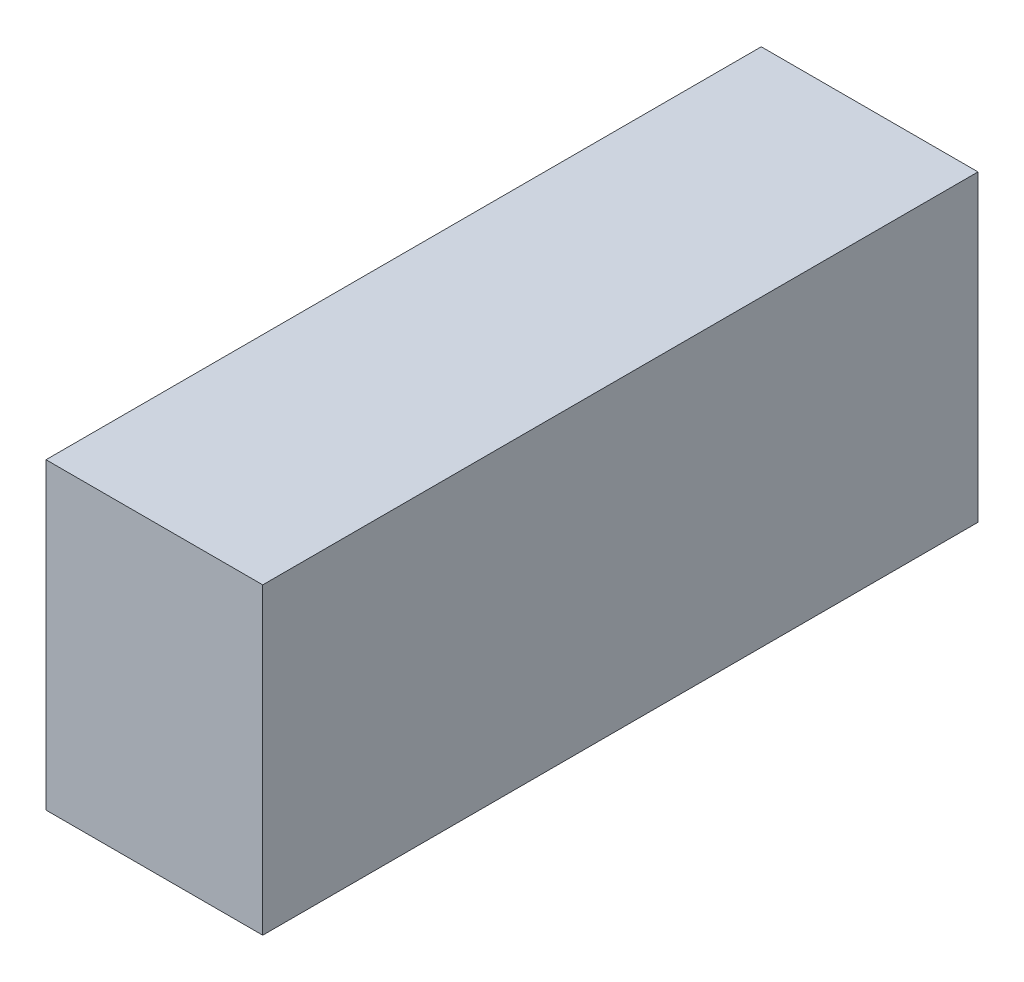
ISO-10303-21;
HEADER;
FILE_DESCRIPTION(('STEP AP214'),'2;1');
FILE_NAME('part.step','',(''),(''),'','','');
FILE_SCHEMA(('AUTOMOTIVE_DESIGN { 1 0 10303 214 1 1 1 1 }'));
ENDSEC;
DATA;
#1=APPLICATION_CONTEXT('core data for automotive mechanical design processes');
#2=APPLICATION_PROTOCOL_DEFINITION('international standard','automotive_design',2000,#1);
#3=PRODUCT_CONTEXT('',#1,'mechanical');
#4=PRODUCT('Part','Part','',(#3));
#5=PRODUCT_RELATED_PRODUCT_CATEGORY('part','',(#4));
#6=PRODUCT_DEFINITION_FORMATION('','',#4);
#7=PRODUCT_DEFINITION_CONTEXT('part definition',#1,'design');
#8=PRODUCT_DEFINITION('design','',#6,#7);
#9=PRODUCT_DEFINITION_SHAPE('','',#8);
#10=(LENGTH_UNIT() NAMED_UNIT(*) SI_UNIT(.MILLI.,.METRE.));
#11=(NAMED_UNIT(*) PLANE_ANGLE_UNIT() SI_UNIT($,.RADIAN.));
#12=(NAMED_UNIT(*) SI_UNIT($,.STERADIAN.) SOLID_ANGLE_UNIT());
#13=UNCERTAINTY_MEASURE_WITH_UNIT(LENGTH_MEASURE(1.E-05),#10,'distance_accuracy_value','');
#14=(GEOMETRIC_REPRESENTATION_CONTEXT(3) GLOBAL_UNCERTAINTY_ASSIGNED_CONTEXT((#13)) GLOBAL_UNIT_ASSIGNED_CONTEXT((#10,
#11,#12)) REPRESENTATION_CONTEXT('',''));
#15=CARTESIAN_POINT('',(0.,0.,0.));
#16=DIRECTION('',(0.,0.,1.));
#17=DIRECTION('',(1.,0.,0.));
#18=AXIS2_PLACEMENT_3D('',#15,#16,#17);
#19=CARTESIAN_POINT('',(-1.27,1.778,0.));
#20=DIRECTION('',(1.,0.,0.));
#21=DIRECTION('',(0.,0.,-1.));
#22=AXIS2_PLACEMENT_3D('',#19,#20,#21);
#23=PLANE('',#22);
#24=DIRECTION('',(0.,0.,1.));
#25=VECTOR('',#24,1.);
#26=CARTESIAN_POINT('',(-1.27,-1.778,0.));
#27=LINE('',#26,#25);
#28=CARTESIAN_POINT('',(-1.27,-1.778,0.));
#29=VERTEX_POINT('',#28);
#30=CARTESIAN_POINT('',(-1.27,-1.778,8.382));
#31=VERTEX_POINT('',#30);
#32=EDGE_CURVE('E20',#29,#31,#27,.T.);
#33=ORIENTED_EDGE('',*,*,#32,.T.);
#34=DIRECTION('',(0.,1.,0.));
#35=VECTOR('',#34,1.);
#36=CARTESIAN_POINT('',(-1.27,-1.778,8.382));
#37=LINE('',#36,#35);
#38=CARTESIAN_POINT('',(-1.27,1.778,8.382));
#39=VERTEX_POINT('',#38);
#40=EDGE_CURVE('E55',#31,#39,#37,.T.);
#41=ORIENTED_EDGE('',*,*,#40,.T.);
#42=DIRECTION('',(0.,0.,-1.));
#43=VECTOR('',#42,1.);
#44=CARTESIAN_POINT('',(-1.27,1.778,0.));
#45=LINE('',#44,#43);
#46=CARTESIAN_POINT('',(-1.27,1.778,0.));
#47=VERTEX_POINT('',#46);
#48=EDGE_CURVE('E76',#39,#47,#45,.T.);
#49=ORIENTED_EDGE('',*,*,#48,.T.);
#50=DIRECTION('',(0.,1.,0.));
#51=VECTOR('',#50,1.);
#52=CARTESIAN_POINT('',(-1.27,-1.778,0.));
#53=LINE('',#52,#51);
#54=EDGE_CURVE('E58',#29,#47,#53,.T.);
#55=ORIENTED_EDGE('',*,*,#54,.F.);
#56=EDGE_LOOP('',(#33,#41,#49,#55));
#57=FACE_BOUND('',#56,.T.);
#58=ADVANCED_FACE('F17',(#57),#23,.F.);
#59=CARTESIAN_POINT('',(-1.27,-1.778,0.));
#60=DIRECTION('',(0.,1.,0.));
#61=DIRECTION('',(0.,0.,1.));
#62=AXIS2_PLACEMENT_3D('',#59,#60,#61);
#63=PLANE('',#62);
#64=DIRECTION('',(0.,0.,1.));
#65=VECTOR('',#64,1.);
#66=CARTESIAN_POINT('',(1.27,-1.778,0.));
#67=LINE('',#66,#65);
#68=CARTESIAN_POINT('',(1.27,-1.778,0.));
#69=VERTEX_POINT('',#68);
#70=CARTESIAN_POINT('',(1.27,-1.778,8.382));
#71=VERTEX_POINT('',#70);
#72=EDGE_CURVE('E73',#69,#71,#67,.T.);
#73=ORIENTED_EDGE('',*,*,#72,.T.);
#74=DIRECTION('',(-1.,0.,0.));
#75=VECTOR('',#74,1.);
#76=CARTESIAN_POINT('',(1.27,-1.778,8.382));
#77=LINE('',#76,#75);
#78=EDGE_CURVE('E63',#71,#31,#77,.T.);
#79=ORIENTED_EDGE('',*,*,#78,.T.);
#80=ORIENTED_EDGE('',*,*,#32,.F.);
#81=DIRECTION('',(-1.,0.,0.));
#82=VECTOR('',#81,1.);
#83=CARTESIAN_POINT('',(1.27,-1.778,0.));
#84=LINE('',#83,#82);
#85=EDGE_CURVE('E78',#69,#29,#84,.T.);
#86=ORIENTED_EDGE('',*,*,#85,.F.);
#87=EDGE_LOOP('',(#73,#79,#80,#86));
#88=FACE_BOUND('',#87,.T.);
#89=ADVANCED_FACE('F72',(#88),#63,.F.);
#90=CARTESIAN_POINT('',(1.27,-1.778,8.382));
#91=DIRECTION('',(0.,0.,-1.));
#92=DIRECTION('',(-1.,0.,0.));
#93=AXIS2_PLACEMENT_3D('',#90,#91,#92);
#94=PLANE('',#93);
#95=DIRECTION('',(1.,0.,0.));
#96=VECTOR('',#95,1.);
#97=CARTESIAN_POINT('',(1.27,1.778,8.382));
#98=LINE('',#97,#96);
#99=CARTESIAN_POINT('',(1.27,1.778,8.382));
#100=VERTEX_POINT('',#99);
#101=EDGE_CURVE('E69',#100,#39,#98,.F.);
#102=ORIENTED_EDGE('',*,*,#101,.T.);
#103=ORIENTED_EDGE('',*,*,#40,.F.);
#104=ORIENTED_EDGE('',*,*,#78,.F.);
#105=DIRECTION('',(0.,1.,0.));
#106=VECTOR('',#105,1.);
#107=CARTESIAN_POINT('',(1.27,-1.778,8.382));
#108=LINE('',#107,#106);
#109=EDGE_CURVE('E83',#71,#100,#108,.T.);
#110=ORIENTED_EDGE('',*,*,#109,.T.);
#111=EDGE_LOOP('',(#102,#103,#104,#110));
#112=FACE_BOUND('',#111,.T.);
#113=ADVANCED_FACE('F66',(#112),#94,.F.);
#114=CARTESIAN_POINT('',(1.27,1.778,0.));
#115=DIRECTION('',(0.,-1.,0.));
#116=DIRECTION('',(0.,0.,-1.));
#117=AXIS2_PLACEMENT_3D('',#114,#115,#116);
#118=PLANE('',#117);
#119=ORIENTED_EDGE('',*,*,#48,.F.);
#120=ORIENTED_EDGE('',*,*,#101,.F.);
#121=DIRECTION('',(0.,0.,1.));
#122=VECTOR('',#121,1.);
#123=CARTESIAN_POINT('',(1.27,1.778,0.));
#124=LINE('',#123,#122);
#125=CARTESIAN_POINT('',(1.27,1.778,0.));
#126=VERTEX_POINT('',#125);
#127=EDGE_CURVE('E26',#100,#126,#124,.F.);
#128=ORIENTED_EDGE('',*,*,#127,.T.);
#129=DIRECTION('',(-1.,0.,0.));
#130=VECTOR('',#129,1.);
#131=CARTESIAN_POINT('',(1.27,1.778,0.));
#132=LINE('',#131,#130);
#133=EDGE_CURVE('E34',#47,#126,#132,.F.);
#134=ORIENTED_EDGE('',*,*,#133,.F.);
#135=EDGE_LOOP('',(#119,#120,#128,#134));
#136=FACE_BOUND('',#135,.T.);
#137=ADVANCED_FACE('F88',(#136),#118,.F.);
#138=CARTESIAN_POINT('',(1.27,-1.778,0.));
#139=DIRECTION('',(0.,0.,-1.));
#140=DIRECTION('',(-1.,0.,0.));
#141=AXIS2_PLACEMENT_3D('',#138,#139,#140);
#142=PLANE('',#141);
#143=ORIENTED_EDGE('',*,*,#133,.T.);
#144=DIRECTION('',(0.,1.,0.));
#145=VECTOR('',#144,1.);
#146=CARTESIAN_POINT('',(1.27,-1.778,0.));
#147=LINE('',#146,#145);
#148=EDGE_CURVE('E11',#126,#69,#147,.F.);
#149=ORIENTED_EDGE('',*,*,#148,.T.);
#150=ORIENTED_EDGE('',*,*,#85,.T.);
#151=ORIENTED_EDGE('',*,*,#54,.T.);
#152=EDGE_LOOP('',(#143,#149,#150,#151));
#153=FACE_BOUND('',#152,.T.);
#154=ADVANCED_FACE('F91',(#153),#142,.T.);
#155=CARTESIAN_POINT('',(1.27,-1.778,0.));
#156=DIRECTION('',(-1.,0.,0.));
#157=DIRECTION('',(0.,0.,1.));
#158=AXIS2_PLACEMENT_3D('',#155,#156,#157);
#159=PLANE('',#158);
#160=ORIENTED_EDGE('',*,*,#127,.F.);
#161=ORIENTED_EDGE('',*,*,#109,.F.);
#162=ORIENTED_EDGE('',*,*,#72,.F.);
#163=ORIENTED_EDGE('',*,*,#148,.F.);
#164=EDGE_LOOP('',(#160,#161,#162,#163));
#165=FACE_BOUND('',#164,.T.);
#166=ADVANCED_FACE('F90',(#165),#159,.F.);
#167=CLOSED_SHELL('',(#58,#89,#113,#137,#154,#166));
#168=MANIFOLD_SOLID_BREP('B1',#167);
#169=ADVANCED_BREP_SHAPE_REPRESENTATION('',(#18,#168),#14);
#170=SHAPE_DEFINITION_REPRESENTATION(#9,#169);
ENDSEC;
END-ISO-10303-21;
